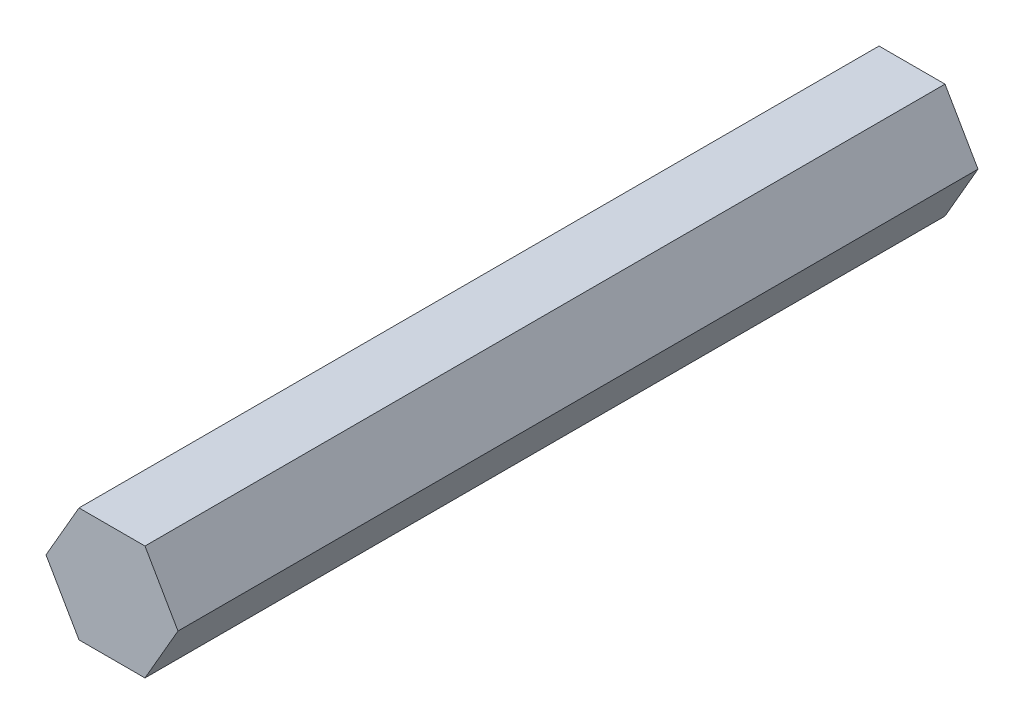
ISO-10303-21;
HEADER;
FILE_DESCRIPTION(('STEP AP214'),'2;1');
FILE_NAME('part.step','',(''),(''),'','','');
FILE_SCHEMA(('AUTOMOTIVE_DESIGN { 1 0 10303 214 1 1 1 1 }'));
ENDSEC;
DATA;
#1=APPLICATION_CONTEXT('core data for automotive mechanical design processes');
#2=APPLICATION_PROTOCOL_DEFINITION('international standard','automotive_design',2000,#1);
#3=PRODUCT_CONTEXT('',#1,'mechanical');
#4=PRODUCT('Part','Part','',(#3));
#5=PRODUCT_RELATED_PRODUCT_CATEGORY('part','',(#4));
#6=PRODUCT_DEFINITION_FORMATION('','',#4);
#7=PRODUCT_DEFINITION_CONTEXT('part definition',#1,'design');
#8=PRODUCT_DEFINITION('design','',#6,#7);
#9=PRODUCT_DEFINITION_SHAPE('','',#8);
#10=(LENGTH_UNIT() NAMED_UNIT(*) SI_UNIT(.MILLI.,.METRE.));
#11=(NAMED_UNIT(*) PLANE_ANGLE_UNIT() SI_UNIT($,.RADIAN.));
#12=(NAMED_UNIT(*) SI_UNIT($,.STERADIAN.) SOLID_ANGLE_UNIT());
#13=UNCERTAINTY_MEASURE_WITH_UNIT(LENGTH_MEASURE(1.E-05),#10,'distance_accuracy_value','');
#14=(GEOMETRIC_REPRESENTATION_CONTEXT(3) GLOBAL_UNCERTAINTY_ASSIGNED_CONTEXT((#13)) GLOBAL_UNIT_ASSIGNED_CONTEXT((#10,
#11,#12)) REPRESENTATION_CONTEXT('',''));
#15=CARTESIAN_POINT('',(0.,0.,0.));
#16=DIRECTION('',(0.,0.,1.));
#17=DIRECTION('',(1.,0.,0.));
#18=AXIS2_PLACEMENT_3D('',#15,#16,#17);
#19=CARTESIAN_POINT('',(3.6661742093542,-6.34999999999996,88.9));
#20=DIRECTION('',(-0.866025403784441,0.499999999999995,0.));
#21=DIRECTION('',(-0.499999999999995,-0.866025403784442,0.));
#22=AXIS2_PLACEMENT_3D('',#19,#20,#21);
#23=PLANE('',#22);
#24=DIRECTION('',(0.499999999999995,0.866025403784442,0.));
#25=VECTOR('',#24,1.);
#26=CARTESIAN_POINT('',(3.6661742093542,-6.34999999999996,0.));
#27=LINE('',#26,#25);
#28=CARTESIAN_POINT('',(3.6661742093542,-6.34999999999996,0.));
#29=VERTEX_POINT('',#28);
#30=CARTESIAN_POINT('',(7.33234841870826,0.,0.));
#31=VERTEX_POINT('',#30);
#32=EDGE_CURVE('E116',#29,#31,#27,.T.);
#33=ORIENTED_EDGE('',*,*,#32,.T.);
#34=DIRECTION('',(0.,0.,-1.));
#35=VECTOR('',#34,1.);
#36=CARTESIAN_POINT('',(7.33234841870826,0.,88.9));
#37=LINE('',#36,#35);
#38=CARTESIAN_POINT('',(7.33234841870826,0.,88.9));
#39=VERTEX_POINT('',#38);
#40=EDGE_CURVE('E11',#39,#31,#37,.T.);
#41=ORIENTED_EDGE('',*,*,#40,.F.);
#42=DIRECTION('',(0.499999999999995,0.866025403784442,0.));
#43=VECTOR('',#42,1.);
#44=CARTESIAN_POINT('',(3.6661742093542,-6.34999999999996,88.9));
#45=LINE('',#44,#43);
#46=CARTESIAN_POINT('',(3.6661742093542,-6.34999999999996,88.9));
#47=VERTEX_POINT('',#46);
#48=EDGE_CURVE('E126',#47,#39,#45,.T.);
#49=ORIENTED_EDGE('',*,*,#48,.F.);
#50=DIRECTION('',(0.,0.,-1.));
#51=VECTOR('',#50,1.);
#52=CARTESIAN_POINT('',(3.6661742093542,-6.34999999999996,88.9));
#53=LINE('',#52,#51);
#54=EDGE_CURVE('E112',#47,#29,#53,.T.);
#55=ORIENTED_EDGE('',*,*,#54,.T.);
#56=EDGE_LOOP('',(#33,#41,#49,#55));
#57=FACE_BOUND('',#56,.T.);
#58=ADVANCED_FACE('F32',(#57),#23,.F.);
#59=CARTESIAN_POINT('',(7.33234841870826,0.,88.9));
#60=DIRECTION('',(-0.866025403784438,-0.500000000000001,0.));
#61=DIRECTION('',(0.500000000000001,-0.866025403784438,0.));
#62=AXIS2_PLACEMENT_3D('',#59,#60,#61);
#63=PLANE('',#62);
#64=DIRECTION('',(-0.500000000000001,0.866025403784438,0.));
#65=VECTOR('',#64,1.);
#66=CARTESIAN_POINT('',(7.33234841870826,0.,0.));
#67=LINE('',#66,#65);
#68=CARTESIAN_POINT('',(3.66617420935411,6.35000000000002,0.));
#69=VERTEX_POINT('',#68);
#70=EDGE_CURVE('E119',#31,#69,#67,.T.);
#71=ORIENTED_EDGE('',*,*,#70,.T.);
#72=DIRECTION('',(0.,0.,-1.));
#73=VECTOR('',#72,1.);
#74=CARTESIAN_POINT('',(3.66617420935411,6.35000000000002,88.9));
#75=LINE('',#74,#73);
#76=CARTESIAN_POINT('',(3.66617420935411,6.35000000000002,88.9));
#77=VERTEX_POINT('',#76);
#78=EDGE_CURVE('E40',#77,#69,#75,.T.);
#79=ORIENTED_EDGE('',*,*,#78,.F.);
#80=DIRECTION('',(-0.500000000000001,0.866025403784438,0.));
#81=VECTOR('',#80,1.);
#82=CARTESIAN_POINT('',(7.33234841870826,0.,88.9));
#83=LINE('',#82,#81);
#84=EDGE_CURVE('E85',#39,#77,#83,.T.);
#85=ORIENTED_EDGE('',*,*,#84,.F.);
#86=ORIENTED_EDGE('',*,*,#40,.T.);
#87=EDGE_LOOP('',(#71,#79,#85,#86));
#88=FACE_BOUND('',#87,.T.);
#89=ADVANCED_FACE('F150',(#88),#63,.F.);
#90=CARTESIAN_POINT('',(3.66617420935411,6.35000000000002,88.9));
#91=DIRECTION('',(0.,-1.,0.));
#92=DIRECTION('',(1.,0.,0.));
#93=AXIS2_PLACEMENT_3D('',#90,#91,#92);
#94=PLANE('',#93);
#95=DIRECTION('',(-1.,0.,0.));
#96=VECTOR('',#95,1.);
#97=CARTESIAN_POINT('',(3.66617420935411,6.35000000000002,0.));
#98=LINE('',#97,#96);
#99=CARTESIAN_POINT('',(-3.66617420935416,6.34999999999999,0.));
#100=VERTEX_POINT('',#99);
#101=EDGE_CURVE('E121',#69,#100,#98,.T.);
#102=ORIENTED_EDGE('',*,*,#101,.T.);
#103=DIRECTION('',(0.,0.,-1.));
#104=VECTOR('',#103,1.);
#105=CARTESIAN_POINT('',(-3.66617420935416,6.34999999999999,88.9));
#106=LINE('',#105,#104);
#107=CARTESIAN_POINT('',(-3.66617420935416,6.34999999999999,88.9));
#108=VERTEX_POINT('',#107);
#109=EDGE_CURVE('E107',#108,#100,#106,.T.);
#110=ORIENTED_EDGE('',*,*,#109,.F.);
#111=DIRECTION('',(-1.,0.,0.));
#112=VECTOR('',#111,1.);
#113=CARTESIAN_POINT('',(3.66617420935411,6.35000000000002,88.9));
#114=LINE('',#113,#112);
#115=EDGE_CURVE('E98',#77,#108,#114,.T.);
#116=ORIENTED_EDGE('',*,*,#115,.F.);
#117=ORIENTED_EDGE('',*,*,#78,.T.);
#118=EDGE_LOOP('',(#102,#110,#116,#117));
#119=FACE_BOUND('',#118,.T.);
#120=ADVANCED_FACE('F132',(#119),#94,.F.);
#121=CARTESIAN_POINT('',(-3.66617420935416,6.34999999999999,88.9));
#122=DIRECTION('',(0.866025403784441,-0.499999999999995,0.));
#123=DIRECTION('',(0.499999999999995,0.866025403784442,0.));
#124=AXIS2_PLACEMENT_3D('',#121,#122,#123);
#125=PLANE('',#124);
#126=DIRECTION('',(-0.499999999999995,-0.866025403784442,0.));
#127=VECTOR('',#126,1.);
#128=CARTESIAN_POINT('',(-3.66617420935416,6.34999999999999,0.));
#129=LINE('',#128,#127);
#130=CARTESIAN_POINT('',(-7.33234841870825,0.,0.));
#131=VERTEX_POINT('',#130);
#132=EDGE_CURVE('E106',#100,#131,#129,.T.);
#133=ORIENTED_EDGE('',*,*,#132,.T.);
#134=DIRECTION('',(0.,0.,-1.));
#135=VECTOR('',#134,1.);
#136=CARTESIAN_POINT('',(-7.33234841870825,0.,88.9));
#137=LINE('',#136,#135);
#138=CARTESIAN_POINT('',(-7.33234841870825,0.,88.9));
#139=VERTEX_POINT('',#138);
#140=EDGE_CURVE('E103',#139,#131,#137,.T.);
#141=ORIENTED_EDGE('',*,*,#140,.F.);
#142=DIRECTION('',(-0.499999999999995,-0.866025403784442,0.));
#143=VECTOR('',#142,1.);
#144=CARTESIAN_POINT('',(-3.66617420935416,6.34999999999999,88.9));
#145=LINE('',#144,#143);
#146=EDGE_CURVE('E92',#108,#139,#145,.T.);
#147=ORIENTED_EDGE('',*,*,#146,.F.);
#148=ORIENTED_EDGE('',*,*,#109,.T.);
#149=EDGE_LOOP('',(#133,#141,#147,#148));
#150=FACE_BOUND('',#149,.T.);
#151=ADVANCED_FACE('F104',(#150),#125,.F.);
#152=CARTESIAN_POINT('',(-7.33234841870825,0.,88.9));
#153=DIRECTION('',(0.866025403784435,0.500000000000007,0.));
#154=DIRECTION('',(-0.500000000000007,0.866025403784435,0.));
#155=AXIS2_PLACEMENT_3D('',#152,#153,#154);
#156=PLANE('',#155);
#157=DIRECTION('',(0.500000000000007,-0.866025403784434,0.));
#158=VECTOR('',#157,1.);
#159=CARTESIAN_POINT('',(-7.33234841870825,0.,0.));
#160=LINE('',#159,#158);
#161=CARTESIAN_POINT('',(-3.66617420935407,-6.35000000000004,0.));
#162=VERTEX_POINT('',#161);
#163=EDGE_CURVE('E71',#131,#162,#160,.T.);
#164=ORIENTED_EDGE('',*,*,#163,.T.);
#165=DIRECTION('',(0.,0.,-1.));
#166=VECTOR('',#165,1.);
#167=CARTESIAN_POINT('',(-3.66617420935407,-6.35000000000004,88.9));
#168=LINE('',#167,#166);
#169=CARTESIAN_POINT('',(-3.66617420935407,-6.35000000000004,88.9));
#170=VERTEX_POINT('',#169);
#171=EDGE_CURVE('E108',#170,#162,#168,.T.);
#172=ORIENTED_EDGE('',*,*,#171,.F.);
#173=DIRECTION('',(0.500000000000007,-0.866025403784434,0.));
#174=VECTOR('',#173,1.);
#175=CARTESIAN_POINT('',(-7.33234841870825,0.,88.9));
#176=LINE('',#175,#174);
#177=EDGE_CURVE('E96',#139,#170,#176,.T.);
#178=ORIENTED_EDGE('',*,*,#177,.F.);
#179=ORIENTED_EDGE('',*,*,#140,.T.);
#180=EDGE_LOOP('',(#164,#172,#178,#179));
#181=FACE_BOUND('',#180,.T.);
#182=ADVANCED_FACE('F110',(#181),#156,.F.);
#183=CARTESIAN_POINT('',(-3.66617420935407,-6.35000000000004,88.9));
#184=DIRECTION('',(0.,1.,0.));
#185=DIRECTION('',(-1.,0.,0.));
#186=AXIS2_PLACEMENT_3D('',#183,#184,#185);
#187=PLANE('',#186);
#188=DIRECTION('',(1.,0.,0.));
#189=VECTOR('',#188,1.);
#190=CARTESIAN_POINT('',(-3.66617420935407,-6.35000000000004,0.));
#191=LINE('',#190,#189);
#192=EDGE_CURVE('E77',#162,#29,#191,.T.);
#193=ORIENTED_EDGE('',*,*,#192,.T.);
#194=ORIENTED_EDGE('',*,*,#54,.F.);
#195=DIRECTION('',(1.,0.,0.));
#196=VECTOR('',#195,1.);
#197=CARTESIAN_POINT('',(-3.66617420935407,-6.35000000000004,88.9));
#198=LINE('',#197,#196);
#199=EDGE_CURVE('E48',#170,#47,#198,.T.);
#200=ORIENTED_EDGE('',*,*,#199,.F.);
#201=ORIENTED_EDGE('',*,*,#171,.T.);
#202=EDGE_LOOP('',(#193,#194,#200,#201));
#203=FACE_BOUND('',#202,.T.);
#204=ADVANCED_FACE('F139',(#203),#187,.F.);
#205=CARTESIAN_POINT('',(0.,0.,88.9));
#206=DIRECTION('',(0.,0.,1.));
#207=DIRECTION('',(1.,0.,0.));
#208=AXIS2_PLACEMENT_3D('',#205,#206,#207);
#209=PLANE('',#208);
#210=ORIENTED_EDGE('',*,*,#48,.T.);
#211=ORIENTED_EDGE('',*,*,#84,.T.);
#212=ORIENTED_EDGE('',*,*,#115,.T.);
#213=ORIENTED_EDGE('',*,*,#146,.T.);
#214=ORIENTED_EDGE('',*,*,#177,.T.);
#215=ORIENTED_EDGE('',*,*,#199,.T.);
#216=EDGE_LOOP('',(#210,#211,#212,#213,#214,#215));
#217=FACE_BOUND('',#216,.T.);
#218=ADVANCED_FACE('F94',(#217),#209,.T.);
#219=CARTESIAN_POINT('',(0.,0.,0.));
#220=DIRECTION('',(0.,0.,1.));
#221=DIRECTION('',(1.,0.,0.));
#222=AXIS2_PLACEMENT_3D('',#219,#220,#221);
#223=PLANE('',#222);
#224=ORIENTED_EDGE('',*,*,#32,.F.);
#225=ORIENTED_EDGE('',*,*,#192,.F.);
#226=ORIENTED_EDGE('',*,*,#163,.F.);
#227=ORIENTED_EDGE('',*,*,#132,.F.);
#228=ORIENTED_EDGE('',*,*,#101,.F.);
#229=ORIENTED_EDGE('',*,*,#70,.F.);
#230=EDGE_LOOP('',(#224,#225,#226,#227,#228,#229));
#231=FACE_BOUND('',#230,.T.);
#232=ADVANCED_FACE('F135',(#231),#223,.F.);
#233=CLOSED_SHELL('',(#58,#89,#120,#151,#182,#204,#218,#232));
#234=MANIFOLD_SOLID_BREP('B2',#233);
#235=ADVANCED_BREP_SHAPE_REPRESENTATION('',(#18,#234),#14);
#236=SHAPE_DEFINITION_REPRESENTATION(#9,#235);
ENDSEC;
END-ISO-10303-21;
